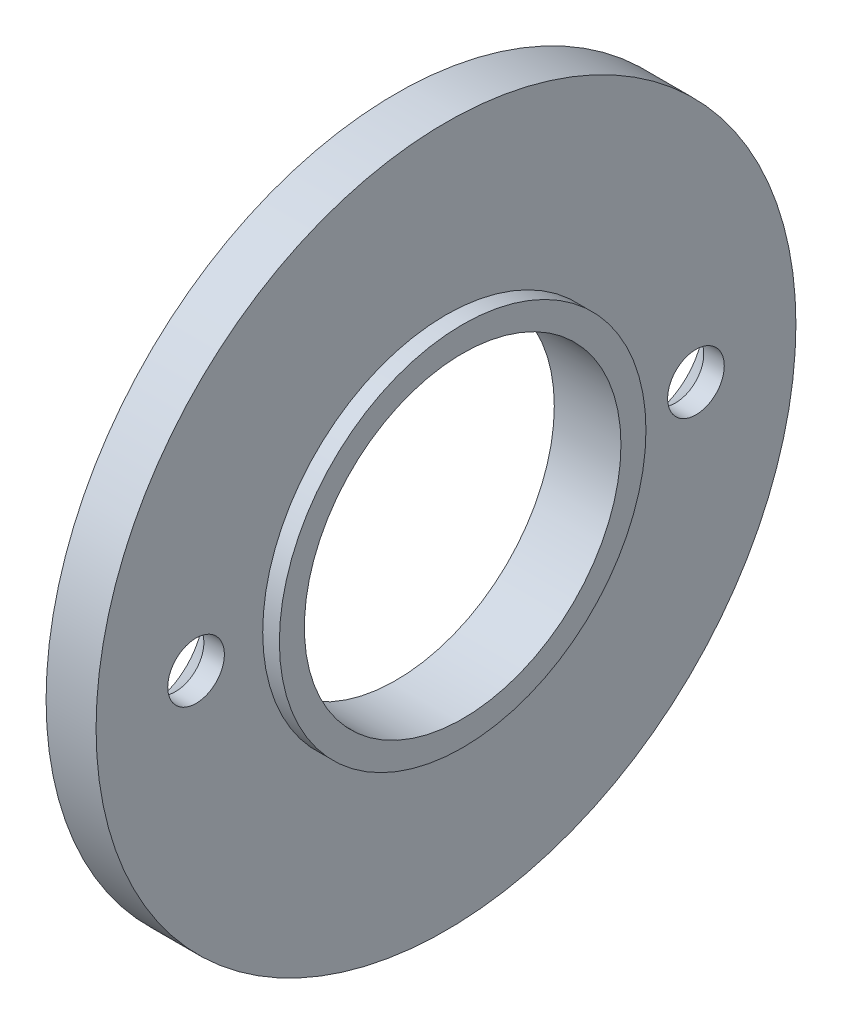
ISO-10303-21;
HEADER;
FILE_DESCRIPTION(('STEP AP214'),'2;1');
FILE_NAME('part.step','',(''),(''),'','','');
FILE_SCHEMA(('AUTOMOTIVE_DESIGN { 1 0 10303 214 1 1 1 1 }'));
ENDSEC;
DATA;
#1=APPLICATION_CONTEXT('core data for automotive mechanical design processes');
#2=APPLICATION_PROTOCOL_DEFINITION('international standard','automotive_design',2000,#1);
#3=PRODUCT_CONTEXT('',#1,'mechanical');
#4=PRODUCT('Part','Part','',(#3));
#5=PRODUCT_RELATED_PRODUCT_CATEGORY('part','',(#4));
#6=PRODUCT_DEFINITION_FORMATION('','',#4);
#7=PRODUCT_DEFINITION_CONTEXT('part definition',#1,'design');
#8=PRODUCT_DEFINITION('design','',#6,#7);
#9=PRODUCT_DEFINITION_SHAPE('','',#8);
#10=(LENGTH_UNIT() NAMED_UNIT(*) SI_UNIT(.MILLI.,.METRE.));
#11=(NAMED_UNIT(*) PLANE_ANGLE_UNIT() SI_UNIT($,.RADIAN.));
#12=(NAMED_UNIT(*) SI_UNIT($,.STERADIAN.) SOLID_ANGLE_UNIT());
#13=UNCERTAINTY_MEASURE_WITH_UNIT(LENGTH_MEASURE(1.E-05),#10,'distance_accuracy_value','');
#14=(GEOMETRIC_REPRESENTATION_CONTEXT(3) GLOBAL_UNCERTAINTY_ASSIGNED_CONTEXT((#13)) GLOBAL_UNIT_ASSIGNED_CONTEXT((#10,
#11,#12)) REPRESENTATION_CONTEXT('',''));
#15=CARTESIAN_POINT('',(0.,0.,0.));
#16=DIRECTION('',(0.,0.,1.));
#17=DIRECTION('',(1.,0.,0.));
#18=AXIS2_PLACEMENT_3D('',#15,#16,#17);
#19=CARTESIAN_POINT('',(-1.5,0.,-21.));
#20=DIRECTION('',(-1.,0.,0.));
#21=DIRECTION('',(0.,0.,1.));
#22=AXIS2_PLACEMENT_3D('',#19,#20,#21);
#23=PLANE('',#22);
#24=CARTESIAN_POINT('',(-1.5,0.,15.));
#25=DIRECTION('',(-1.,0.,0.));
#26=DIRECTION('',(0.,0.,1.));
#27=AXIS2_PLACEMENT_3D('',#24,#25,#26);
#28=CIRCLE('',#27,3.47);
#29=CARTESIAN_POINT('',(-1.5,0.,18.47));
#30=VERTEX_POINT('',#29);
#31=EDGE_CURVE('E72',#30,#30,#28,.T.);
#32=ORIENTED_EDGE('',*,*,#31,.F.);
#33=EDGE_LOOP('',(#32));
#34=FACE_BOUND('',#33,.T.);
#35=CARTESIAN_POINT('',(-1.5,0.,-15.));
#36=DIRECTION('',(-1.,0.,0.));
#37=DIRECTION('',(0.,0.,1.));
#38=AXIS2_PLACEMENT_3D('',#35,#36,#37);
#39=CIRCLE('',#38,3.47);
#40=CARTESIAN_POINT('',(-1.5,0.,-11.53));
#41=VERTEX_POINT('',#40);
#42=EDGE_CURVE('E63',#41,#41,#39,.T.);
#43=ORIENTED_EDGE('',*,*,#42,.F.);
#44=EDGE_LOOP('',(#43));
#45=FACE_BOUND('',#44,.T.);
#46=CARTESIAN_POINT('',(-1.5,0.,0.));
#47=DIRECTION('',(1.,0.,0.));
#48=DIRECTION('',(0.,0.,-1.));
#49=AXIS2_PLACEMENT_3D('',#46,#47,#48);
#50=CIRCLE('',#49,9.5);
#51=CARTESIAN_POINT('',(-1.5,0.,-9.5));
#52=VERTEX_POINT('',#51);
#53=EDGE_CURVE('E10',#52,#52,#50,.T.);
#54=ORIENTED_EDGE('',*,*,#53,.T.);
#55=EDGE_LOOP('',(#54));
#56=FACE_BOUND('',#55,.T.);
#57=CARTESIAN_POINT('',(-1.5,0.,0.));
#58=DIRECTION('',(1.,0.,0.));
#59=DIRECTION('',(0.,0.,-1.));
#60=AXIS2_PLACEMENT_3D('',#57,#58,#59);
#61=CIRCLE('',#60,21.);
#62=CARTESIAN_POINT('',(-1.5,0.,-21.));
#63=VERTEX_POINT('',#62);
#64=EDGE_CURVE('E54',#63,#63,#61,.T.);
#65=ORIENTED_EDGE('',*,*,#64,.F.);
#66=EDGE_LOOP('',(#65));
#67=FACE_BOUND('',#66,.T.);
#68=ADVANCED_FACE('F32',(#34,#45,#56,#67),#23,.T.);
#69=CARTESIAN_POINT('',(88.99,0.,0.));
#70=DIRECTION('',(1.,0.,0.));
#71=DIRECTION('',(0.,0.,-1.));
#72=AXIS2_PLACEMENT_3D('',#69,#70,#71);
#73=CYLINDRICAL_SURFACE('',#72,9.5);
#74=CARTESIAN_POINT('',(2.5,0.,0.));
#75=DIRECTION('',(1.,0.,0.));
#76=DIRECTION('',(0.,0.,-1.));
#77=AXIS2_PLACEMENT_3D('',#74,#75,#76);
#78=CIRCLE('',#77,9.5);
#79=CARTESIAN_POINT('',(2.5,0.,-9.5));
#80=VERTEX_POINT('',#79);
#81=EDGE_CURVE('E38',#80,#80,#78,.T.);
#82=ORIENTED_EDGE('',*,*,#81,.T.);
#83=EDGE_LOOP('',(#82));
#84=FACE_BOUND('',#83,.T.);
#85=ORIENTED_EDGE('',*,*,#53,.F.);
#86=EDGE_LOOP('',(#85));
#87=FACE_BOUND('',#86,.T.);
#88=ADVANCED_FACE('F80',(#84,#87),#73,.F.);
#89=CARTESIAN_POINT('',(2.5,0.,-9.5));
#90=DIRECTION('',(1.,0.,0.));
#91=DIRECTION('',(0.,0.,-1.));
#92=AXIS2_PLACEMENT_3D('',#89,#90,#91);
#93=PLANE('',#92);
#94=CARTESIAN_POINT('',(2.5,0.,0.));
#95=DIRECTION('',(1.,0.,0.));
#96=DIRECTION('',(0.,0.,-1.));
#97=AXIS2_PLACEMENT_3D('',#94,#95,#96);
#98=CIRCLE('',#97,11.);
#99=CARTESIAN_POINT('',(2.5,0.,-11.));
#100=VERTEX_POINT('',#99);
#101=EDGE_CURVE('E42',#100,#100,#98,.T.);
#102=ORIENTED_EDGE('',*,*,#101,.T.);
#103=EDGE_LOOP('',(#102));
#104=FACE_BOUND('',#103,.T.);
#105=ORIENTED_EDGE('',*,*,#81,.F.);
#106=EDGE_LOOP('',(#105));
#107=FACE_BOUND('',#106,.T.);
#108=ADVANCED_FACE('F102',(#104,#107),#93,.T.);
#109=CARTESIAN_POINT('',(88.99,0.,0.));
#110=DIRECTION('',(1.,0.,0.));
#111=DIRECTION('',(0.,0.,-1.));
#112=AXIS2_PLACEMENT_3D('',#109,#110,#111);
#113=CYLINDRICAL_SURFACE('',#112,11.);
#114=CARTESIAN_POINT('',(1.5,0.,0.));
#115=DIRECTION('',(1.,0.,0.));
#116=DIRECTION('',(0.,0.,-1.));
#117=AXIS2_PLACEMENT_3D('',#114,#115,#116);
#118=CIRCLE('',#117,11.);
#119=CARTESIAN_POINT('',(1.5,0.,-11.));
#120=VERTEX_POINT('',#119);
#121=EDGE_CURVE('E46',#120,#120,#118,.T.);
#122=ORIENTED_EDGE('',*,*,#121,.T.);
#123=EDGE_LOOP('',(#122));
#124=FACE_BOUND('',#123,.T.);
#125=ORIENTED_EDGE('',*,*,#101,.F.);
#126=EDGE_LOOP('',(#125));
#127=FACE_BOUND('',#126,.T.);
#128=ADVANCED_FACE('F95',(#124,#127),#113,.T.);
#129=CARTESIAN_POINT('',(1.5,0.,-21.));
#130=DIRECTION('',(1.,0.,0.));
#131=DIRECTION('',(0.,0.,-1.));
#132=AXIS2_PLACEMENT_3D('',#129,#130,#131);
#133=PLANE('',#132);
#134=CARTESIAN_POINT('',(1.5,0.,15.));
#135=DIRECTION('',(1.,0.,0.));
#136=DIRECTION('',(0.,0.,-1.));
#137=AXIS2_PLACEMENT_3D('',#134,#135,#136);
#138=CIRCLE('',#137,1.7);
#139=CARTESIAN_POINT('',(1.5,0.,13.3));
#140=VERTEX_POINT('',#139);
#141=EDGE_CURVE('E66',#140,#140,#138,.T.);
#142=ORIENTED_EDGE('',*,*,#141,.F.);
#143=EDGE_LOOP('',(#142));
#144=FACE_BOUND('',#143,.T.);
#145=CARTESIAN_POINT('',(1.5,0.,-15.));
#146=DIRECTION('',(1.,0.,0.));
#147=DIRECTION('',(0.,0.,-1.));
#148=AXIS2_PLACEMENT_3D('',#145,#146,#147);
#149=CIRCLE('',#148,1.7);
#150=CARTESIAN_POINT('',(1.5,0.,-16.7));
#151=VERTEX_POINT('',#150);
#152=EDGE_CURVE('E57',#151,#151,#149,.T.);
#153=ORIENTED_EDGE('',*,*,#152,.F.);
#154=EDGE_LOOP('',(#153));
#155=FACE_BOUND('',#154,.T.);
#156=CARTESIAN_POINT('',(1.5,0.,0.));
#157=DIRECTION('',(1.,0.,0.));
#158=DIRECTION('',(0.,0.,-1.));
#159=AXIS2_PLACEMENT_3D('',#156,#157,#158);
#160=CIRCLE('',#159,21.);
#161=CARTESIAN_POINT('',(1.5,0.,-21.));
#162=VERTEX_POINT('',#161);
#163=EDGE_CURVE('E51',#162,#162,#160,.T.);
#164=ORIENTED_EDGE('',*,*,#163,.T.);
#165=EDGE_LOOP('',(#164));
#166=FACE_BOUND('',#165,.T.);
#167=ORIENTED_EDGE('',*,*,#121,.F.);
#168=EDGE_LOOP('',(#167));
#169=FACE_BOUND('',#168,.T.);
#170=ADVANCED_FACE('F89',(#144,#155,#166,#169),#133,.T.);
#171=CARTESIAN_POINT('',(88.99,0.,0.));
#172=DIRECTION('',(1.,0.,0.));
#173=DIRECTION('',(0.,0.,-1.));
#174=AXIS2_PLACEMENT_3D('',#171,#172,#173);
#175=CYLINDRICAL_SURFACE('',#174,21.);
#176=ORIENTED_EDGE('',*,*,#64,.T.);
#177=EDGE_LOOP('',(#176));
#178=FACE_BOUND('',#177,.T.);
#179=ORIENTED_EDGE('',*,*,#163,.F.);
#180=EDGE_LOOP('',(#179));
#181=FACE_BOUND('',#180,.T.);
#182=ADVANCED_FACE('F85',(#178,#181),#175,.T.);
#183=CARTESIAN_POINT('',(-1.5,0.,-15.));
#184=DIRECTION('',(-1.,0.,0.));
#185=DIRECTION('',(0.,0.,1.));
#186=AXIS2_PLACEMENT_3D('',#183,#184,#185);
#187=CYLINDRICAL_SURFACE('',#186,1.7);
#188=CARTESIAN_POINT('',(0.27,0.,-15.));
#189=DIRECTION('',(-1.,0.,0.));
#190=DIRECTION('',(0.,0.,1.));
#191=AXIS2_PLACEMENT_3D('',#188,#189,#190);
#192=CIRCLE('',#191,1.7);
#193=CARTESIAN_POINT('',(0.27,0.,-13.3));
#194=VERTEX_POINT('',#193);
#195=EDGE_CURVE('E60',#194,#194,#192,.T.);
#196=ORIENTED_EDGE('',*,*,#195,.T.);
#197=EDGE_LOOP('',(#196));
#198=FACE_BOUND('',#197,.T.);
#199=ORIENTED_EDGE('',*,*,#152,.T.);
#200=EDGE_LOOP('',(#199));
#201=FACE_BOUND('',#200,.T.);
#202=ADVANCED_FACE('F88',(#198,#201),#187,.F.);
#203=CARTESIAN_POINT('',(-1.5,0.,-15.));
#204=DIRECTION('',(-1.,0.,0.));
#205=DIRECTION('',(0.,0.,1.));
#206=AXIS2_PLACEMENT_3D('',#203,#204,#205);
#207=CONICAL_SURFACE('',#206,3.47,0.785398163397449);
#208=ORIENTED_EDGE('',*,*,#195,.F.);
#209=EDGE_LOOP('',(#208));
#210=FACE_BOUND('',#209,.T.);
#211=ORIENTED_EDGE('',*,*,#42,.T.);
#212=EDGE_LOOP('',(#211));
#213=FACE_BOUND('',#212,.T.);
#214=ADVANCED_FACE('F115',(#210,#213),#207,.F.);
#215=CARTESIAN_POINT('',(-1.5,0.,15.));
#216=DIRECTION('',(-1.,0.,0.));
#217=DIRECTION('',(0.,0.,1.));
#218=AXIS2_PLACEMENT_3D('',#215,#216,#217);
#219=CYLINDRICAL_SURFACE('',#218,1.7);
#220=CARTESIAN_POINT('',(0.27,0.,15.));
#221=DIRECTION('',(-1.,0.,0.));
#222=DIRECTION('',(0.,0.,1.));
#223=AXIS2_PLACEMENT_3D('',#220,#221,#222);
#224=CIRCLE('',#223,1.7);
#225=CARTESIAN_POINT('',(0.27,0.,16.7));
#226=VERTEX_POINT('',#225);
#227=EDGE_CURVE('E69',#226,#226,#224,.T.);
#228=ORIENTED_EDGE('',*,*,#227,.T.);
#229=EDGE_LOOP('',(#228));
#230=FACE_BOUND('',#229,.T.);
#231=ORIENTED_EDGE('',*,*,#141,.T.);
#232=EDGE_LOOP('',(#231));
#233=FACE_BOUND('',#232,.T.);
#234=ADVANCED_FACE('F119',(#230,#233),#219,.F.);
#235=CARTESIAN_POINT('',(-1.5,0.,15.));
#236=DIRECTION('',(-1.,0.,0.));
#237=DIRECTION('',(0.,0.,1.));
#238=AXIS2_PLACEMENT_3D('',#235,#236,#237);
#239=CONICAL_SURFACE('',#238,3.47,0.785398163397449);
#240=ORIENTED_EDGE('',*,*,#227,.F.);
#241=EDGE_LOOP('',(#240));
#242=FACE_BOUND('',#241,.T.);
#243=ORIENTED_EDGE('',*,*,#31,.T.);
#244=EDGE_LOOP('',(#243));
#245=FACE_BOUND('',#244,.T.);
#246=ADVANCED_FACE('F76',(#242,#245),#239,.F.);
#247=CLOSED_SHELL('',(#68,#88,#108,#128,#170,#182,#202,#214,#234,#246));
#248=MANIFOLD_SOLID_BREP('B2',#247);
#249=ADVANCED_BREP_SHAPE_REPRESENTATION('',(#18,#248),#14);
#250=SHAPE_DEFINITION_REPRESENTATION(#9,#249);
ENDSEC;
END-ISO-10303-21;
